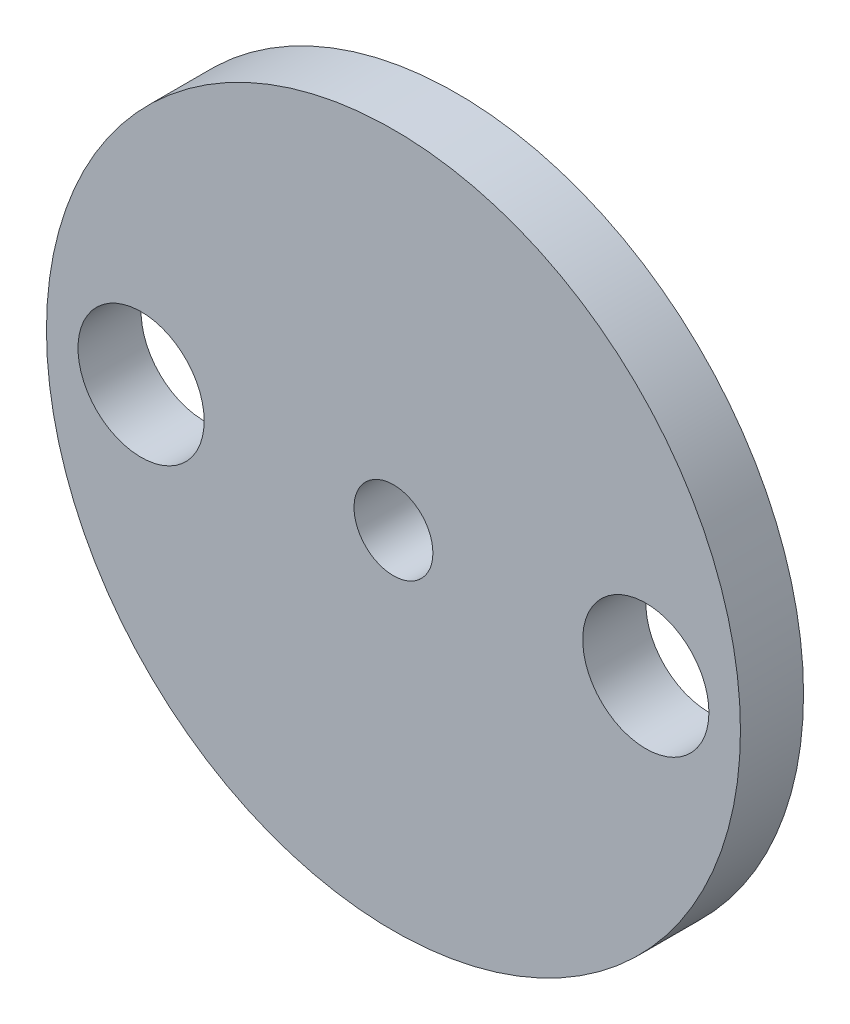
ISO-10303-21;
HEADER;
FILE_DESCRIPTION(('STEP AP214'),'2;1');
FILE_NAME('part.step','',(''),(''),'','','');
FILE_SCHEMA(('AUTOMOTIVE_DESIGN { 1 0 10303 214 1 1 1 1 }'));
ENDSEC;
DATA;
#1=APPLICATION_CONTEXT('core data for automotive mechanical design processes');
#2=APPLICATION_PROTOCOL_DEFINITION('international standard','automotive_design',2000,#1);
#3=PRODUCT_CONTEXT('',#1,'mechanical');
#4=PRODUCT('Part','Part','',(#3));
#5=PRODUCT_RELATED_PRODUCT_CATEGORY('part','',(#4));
#6=PRODUCT_DEFINITION_FORMATION('','',#4);
#7=PRODUCT_DEFINITION_CONTEXT('part definition',#1,'design');
#8=PRODUCT_DEFINITION('design','',#6,#7);
#9=PRODUCT_DEFINITION_SHAPE('','',#8);
#10=(LENGTH_UNIT() NAMED_UNIT(*) SI_UNIT(.MILLI.,.METRE.));
#11=(NAMED_UNIT(*) PLANE_ANGLE_UNIT() SI_UNIT($,.RADIAN.));
#12=(NAMED_UNIT(*) SI_UNIT($,.STERADIAN.) SOLID_ANGLE_UNIT());
#13=UNCERTAINTY_MEASURE_WITH_UNIT(LENGTH_MEASURE(1.E-05),#10,'distance_accuracy_value','');
#14=(GEOMETRIC_REPRESENTATION_CONTEXT(3) GLOBAL_UNCERTAINTY_ASSIGNED_CONTEXT((#13)) GLOBAL_UNIT_ASSIGNED_CONTEXT((#10,
#11,#12)) REPRESENTATION_CONTEXT('',''));
#15=CARTESIAN_POINT('',(0.,0.,0.));
#16=DIRECTION('',(0.,0.,1.));
#17=DIRECTION('',(1.,0.,0.));
#18=AXIS2_PLACEMENT_3D('',#15,#16,#17);
#19=CARTESIAN_POINT('',(0.,0.,2.));
#20=DIRECTION('',(0.,0.,1.));
#21=DIRECTION('',(1.,0.,0.));
#22=AXIS2_PLACEMENT_3D('',#19,#20,#21);
#23=PLANE('',#22);
#24=CARTESIAN_POINT('',(-8.00000000000001,0.,2.));
#25=DIRECTION('',(0.,0.,1.));
#26=DIRECTION('',(1.,0.,0.));
#27=AXIS2_PLACEMENT_3D('',#24,#25,#26);
#28=CIRCLE('',#27,1.99999999999978);
#29=CARTESIAN_POINT('',(-6.00000000000023,0.,2.));
#30=VERTEX_POINT('',#29);
#31=EDGE_CURVE('E47',#30,#30,#28,.T.);
#32=ORIENTED_EDGE('',*,*,#31,.F.);
#33=EDGE_LOOP('',(#32));
#34=FACE_BOUND('',#33,.T.);
#35=CARTESIAN_POINT('',(0.,0.,2.));
#36=DIRECTION('',(0.,0.,1.));
#37=DIRECTION('',(1.,0.,0.));
#38=AXIS2_PLACEMENT_3D('',#35,#36,#37);
#39=CIRCLE('',#38,11.0000000000001);
#40=CARTESIAN_POINT('',(11.0000000000001,0.,2.));
#41=VERTEX_POINT('',#40);
#42=EDGE_CURVE('E10',#41,#41,#39,.T.);
#43=ORIENTED_EDGE('',*,*,#42,.T.);
#44=EDGE_LOOP('',(#43));
#45=FACE_BOUND('',#44,.T.);
#46=CARTESIAN_POINT('',(8.00000000000001,0.,2.));
#47=DIRECTION('',(0.,0.,1.));
#48=DIRECTION('',(1.,0.,0.));
#49=AXIS2_PLACEMENT_3D('',#46,#47,#48);
#50=CIRCLE('',#49,1.99999999999978);
#51=CARTESIAN_POINT('',(9.99999999999979,0.,2.));
#52=VERTEX_POINT('',#51);
#53=EDGE_CURVE('E42',#52,#52,#50,.T.);
#54=ORIENTED_EDGE('',*,*,#53,.F.);
#55=EDGE_LOOP('',(#54));
#56=FACE_BOUND('',#55,.T.);
#57=CARTESIAN_POINT('',(0.,0.,2.));
#58=DIRECTION('',(0.,0.,1.));
#59=DIRECTION('',(1.,0.,0.));
#60=AXIS2_PLACEMENT_3D('',#57,#58,#59);
#61=CIRCLE('',#60,1.2500000000002);
#62=CARTESIAN_POINT('',(1.2500000000002,0.,2.));
#63=VERTEX_POINT('',#62);
#64=EDGE_CURVE('E53',#63,#63,#61,.T.);
#65=ORIENTED_EDGE('',*,*,#64,.F.);
#66=EDGE_LOOP('',(#65));
#67=FACE_BOUND('',#66,.T.);
#68=ADVANCED_FACE('F31',(#34,#45,#56,#67),#23,.T.);
#69=CARTESIAN_POINT('',(0.,0.,0.));
#70=DIRECTION('',(0.,0.,1.));
#71=DIRECTION('',(1.,0.,0.));
#72=AXIS2_PLACEMENT_3D('',#69,#70,#71);
#73=PLANE('',#72);
#74=CARTESIAN_POINT('',(-8.00000000000001,0.,0.));
#75=DIRECTION('',(0.,0.,1.));
#76=DIRECTION('',(1.,0.,0.));
#77=AXIS2_PLACEMENT_3D('',#74,#75,#76);
#78=CIRCLE('',#77,1.99999999999978);
#79=CARTESIAN_POINT('',(-6.00000000000023,0.,0.));
#80=VERTEX_POINT('',#79);
#81=EDGE_CURVE('E50',#80,#80,#78,.T.);
#82=ORIENTED_EDGE('',*,*,#81,.T.);
#83=EDGE_LOOP('',(#82));
#84=FACE_BOUND('',#83,.T.);
#85=CARTESIAN_POINT('',(0.,0.,0.));
#86=DIRECTION('',(0.,0.,1.));
#87=DIRECTION('',(1.,0.,0.));
#88=AXIS2_PLACEMENT_3D('',#85,#86,#87);
#89=CIRCLE('',#88,11.0000000000001);
#90=CARTESIAN_POINT('',(11.0000000000001,0.,0.));
#91=VERTEX_POINT('',#90);
#92=EDGE_CURVE('E35',#91,#91,#89,.T.);
#93=ORIENTED_EDGE('',*,*,#92,.F.);
#94=EDGE_LOOP('',(#93));
#95=FACE_BOUND('',#94,.T.);
#96=CARTESIAN_POINT('',(8.00000000000001,0.,0.));
#97=DIRECTION('',(0.,0.,1.));
#98=DIRECTION('',(1.,0.,0.));
#99=AXIS2_PLACEMENT_3D('',#96,#97,#98);
#100=CIRCLE('',#99,1.99999999999978);
#101=CARTESIAN_POINT('',(9.99999999999979,0.,0.));
#102=VERTEX_POINT('',#101);
#103=EDGE_CURVE('E44',#102,#102,#100,.T.);
#104=ORIENTED_EDGE('',*,*,#103,.T.);
#105=EDGE_LOOP('',(#104));
#106=FACE_BOUND('',#105,.T.);
#107=CARTESIAN_POINT('',(0.,0.,0.));
#108=DIRECTION('',(0.,0.,1.));
#109=DIRECTION('',(1.,0.,0.));
#110=AXIS2_PLACEMENT_3D('',#107,#108,#109);
#111=CIRCLE('',#110,1.2500000000002);
#112=CARTESIAN_POINT('',(1.2500000000002,0.,0.));
#113=VERTEX_POINT('',#112);
#114=EDGE_CURVE('E56',#113,#113,#111,.T.);
#115=ORIENTED_EDGE('',*,*,#114,.T.);
#116=EDGE_LOOP('',(#115));
#117=FACE_BOUND('',#116,.T.);
#118=ADVANCED_FACE('F66',(#84,#95,#106,#117),#73,.F.);
#119=CARTESIAN_POINT('',(0.,0.,2.));
#120=DIRECTION('',(0.,0.,-1.));
#121=DIRECTION('',(-1.,0.,0.));
#122=AXIS2_PLACEMENT_3D('',#119,#120,#121);
#123=CYLINDRICAL_SURFACE('',#122,11.0000000000001);
#124=ORIENTED_EDGE('',*,*,#42,.F.);
#125=EDGE_LOOP('',(#124));
#126=FACE_BOUND('',#125,.T.);
#127=ORIENTED_EDGE('',*,*,#92,.T.);
#128=EDGE_LOOP('',(#127));
#129=FACE_BOUND('',#128,.T.);
#130=ADVANCED_FACE('F33',(#126,#129),#123,.T.);
#131=CARTESIAN_POINT('',(8.00000000000001,0.,2.));
#132=DIRECTION('',(0.,0.,-1.));
#133=DIRECTION('',(-1.,0.,0.));
#134=AXIS2_PLACEMENT_3D('',#131,#132,#133);
#135=CYLINDRICAL_SURFACE('',#134,1.99999999999978);
#136=ORIENTED_EDGE('',*,*,#53,.T.);
#137=EDGE_LOOP('',(#136));
#138=FACE_BOUND('',#137,.T.);
#139=ORIENTED_EDGE('',*,*,#103,.F.);
#140=EDGE_LOOP('',(#139));
#141=FACE_BOUND('',#140,.T.);
#142=ADVANCED_FACE('F75',(#138,#141),#135,.F.);
#143=CARTESIAN_POINT('',(-8.00000000000001,0.,2.));
#144=DIRECTION('',(0.,0.,-1.));
#145=DIRECTION('',(-1.,0.,0.));
#146=AXIS2_PLACEMENT_3D('',#143,#144,#145);
#147=CYLINDRICAL_SURFACE('',#146,1.99999999999978);
#148=ORIENTED_EDGE('',*,*,#31,.T.);
#149=EDGE_LOOP('',(#148));
#150=FACE_BOUND('',#149,.T.);
#151=ORIENTED_EDGE('',*,*,#81,.F.);
#152=EDGE_LOOP('',(#151));
#153=FACE_BOUND('',#152,.T.);
#154=ADVANCED_FACE('F78',(#150,#153),#147,.F.);
#155=CARTESIAN_POINT('',(0.,0.,2.));
#156=DIRECTION('',(0.,0.,-1.));
#157=DIRECTION('',(-1.,0.,0.));
#158=AXIS2_PLACEMENT_3D('',#155,#156,#157);
#159=CYLINDRICAL_SURFACE('',#158,1.2500000000002);
#160=ORIENTED_EDGE('',*,*,#64,.T.);
#161=EDGE_LOOP('',(#160));
#162=FACE_BOUND('',#161,.T.);
#163=ORIENTED_EDGE('',*,*,#114,.F.);
#164=EDGE_LOOP('',(#163));
#165=FACE_BOUND('',#164,.T.);
#166=ADVANCED_FACE('F62',(#162,#165),#159,.F.);
#167=CLOSED_SHELL('',(#68,#118,#130,#142,#154,#166));
#168=MANIFOLD_SOLID_BREP('B2',#167);
#169=ADVANCED_BREP_SHAPE_REPRESENTATION('',(#18,#168),#14);
#170=SHAPE_DEFINITION_REPRESENTATION(#9,#169);
ENDSEC;
END-ISO-10303-21;
